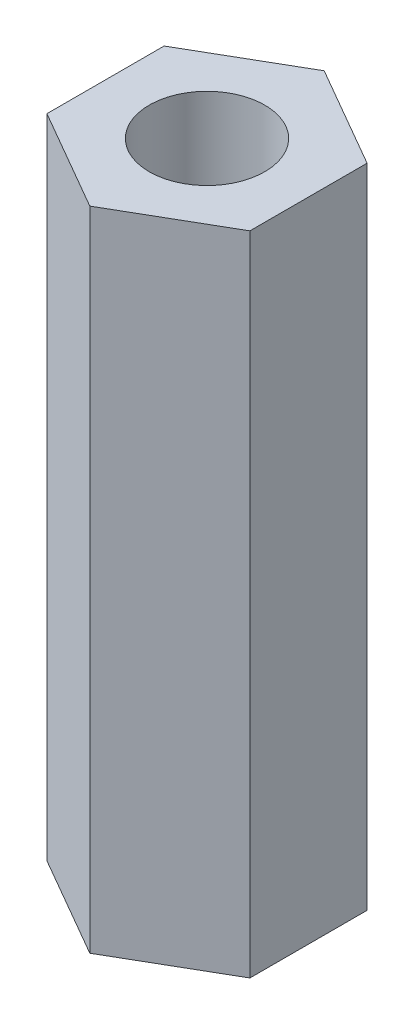
ISO-10303-21;
HEADER;
FILE_DESCRIPTION(('STEP AP214'),'2;1');
FILE_NAME('part.step','',(''),(''),'','','');
FILE_SCHEMA(('AUTOMOTIVE_DESIGN { 1 0 10303 214 1 1 1 1 }'));
ENDSEC;
DATA;
#1=APPLICATION_CONTEXT('core data for automotive mechanical design processes');
#2=APPLICATION_PROTOCOL_DEFINITION('international standard','automotive_design',2000,#1);
#3=PRODUCT_CONTEXT('',#1,'mechanical');
#4=PRODUCT('Part','Part','',(#3));
#5=PRODUCT_RELATED_PRODUCT_CATEGORY('part','',(#4));
#6=PRODUCT_DEFINITION_FORMATION('','',#4);
#7=PRODUCT_DEFINITION_CONTEXT('part definition',#1,'design');
#8=PRODUCT_DEFINITION('design','',#6,#7);
#9=PRODUCT_DEFINITION_SHAPE('','',#8);
#10=(LENGTH_UNIT() NAMED_UNIT(*) SI_UNIT(.MILLI.,.METRE.));
#11=(NAMED_UNIT(*) PLANE_ANGLE_UNIT() SI_UNIT($,.RADIAN.));
#12=(NAMED_UNIT(*) SI_UNIT($,.STERADIAN.) SOLID_ANGLE_UNIT());
#13=UNCERTAINTY_MEASURE_WITH_UNIT(LENGTH_MEASURE(1.E-05),#10,'distance_accuracy_value','');
#14=(GEOMETRIC_REPRESENTATION_CONTEXT(3) GLOBAL_UNCERTAINTY_ASSIGNED_CONTEXT((#13)) GLOBAL_UNIT_ASSIGNED_CONTEXT((#10,
#11,#12)) REPRESENTATION_CONTEXT('',''));
#15=CARTESIAN_POINT('',(0.,0.,0.));
#16=DIRECTION('',(0.,0.,1.));
#17=DIRECTION('',(1.,0.,0.));
#18=AXIS2_PLACEMENT_3D('',#15,#16,#17);
#19=CARTESIAN_POINT('',(0.,16.8,0.));
#20=DIRECTION('',(0.,1.,0.));
#21=DIRECTION('',(0.,0.,1.));
#22=AXIS2_PLACEMENT_3D('',#19,#20,#21);
#23=PLANE('',#22);
#24=DIRECTION('',(-0.866025403784439,0.,-0.5));
#25=VECTOR('',#24,1.);
#26=CARTESIAN_POINT('',(2.635,16.8,-1.52131795931467));
#27=LINE('',#26,#25);
#28=CARTESIAN_POINT('',(2.635,16.8,-1.52131795931467));
#29=VERTEX_POINT('',#28);
#30=CARTESIAN_POINT('',(0.,16.8,-3.04263591862933));
#31=VERTEX_POINT('',#30);
#32=EDGE_CURVE('E131',#29,#31,#27,.T.);
#33=ORIENTED_EDGE('',*,*,#32,.T.);
#34=DIRECTION('',(-0.866025403784439,0.,0.5));
#35=VECTOR('',#34,1.);
#36=CARTESIAN_POINT('',(0.,16.8,-3.04263591862933));
#37=LINE('',#36,#35);
#38=CARTESIAN_POINT('',(-2.635,16.8,-1.52131795931466));
#39=VERTEX_POINT('',#38);
#40=EDGE_CURVE('E89',#31,#39,#37,.T.);
#41=ORIENTED_EDGE('',*,*,#40,.T.);
#42=DIRECTION('',(0.,0.,1.));
#43=VECTOR('',#42,1.);
#44=CARTESIAN_POINT('',(-2.635,16.8,-1.52131795931466));
#45=LINE('',#44,#43);
#46=CARTESIAN_POINT('',(-2.635,16.8,1.52131795931466));
#47=VERTEX_POINT('',#46);
#48=EDGE_CURVE('E102',#39,#47,#45,.T.);
#49=ORIENTED_EDGE('',*,*,#48,.T.);
#50=DIRECTION('',(0.866025403784439,0.,0.5));
#51=VECTOR('',#50,1.);
#52=CARTESIAN_POINT('',(-2.635,16.8,1.52131795931466));
#53=LINE('',#52,#51);
#54=CARTESIAN_POINT('',(0.,16.8,3.04263591862933));
#55=VERTEX_POINT('',#54);
#56=EDGE_CURVE('E96',#47,#55,#53,.T.);
#57=ORIENTED_EDGE('',*,*,#56,.T.);
#58=DIRECTION('',(0.866025403784439,0.,-0.5));
#59=VECTOR('',#58,1.);
#60=CARTESIAN_POINT('',(0.,16.8,3.04263591862933));
#61=LINE('',#60,#59);
#62=CARTESIAN_POINT('',(2.635,16.8,1.52131795931466));
#63=VERTEX_POINT('',#62);
#64=EDGE_CURVE('E100',#55,#63,#61,.T.);
#65=ORIENTED_EDGE('',*,*,#64,.T.);
#66=DIRECTION('',(0.,0.,-1.));
#67=VECTOR('',#66,1.);
#68=CARTESIAN_POINT('',(2.635,16.8,1.52131795931466));
#69=LINE('',#68,#67);
#70=EDGE_CURVE('E52',#63,#29,#69,.T.);
#71=ORIENTED_EDGE('',*,*,#70,.T.);
#72=EDGE_LOOP('',(#33,#41,#49,#57,#65,#71));
#73=FACE_BOUND('',#72,.T.);
#74=CARTESIAN_POINT('',(0.,16.8,0.));
#75=DIRECTION('',(0.,1.,0.));
#76=DIRECTION('',(0.,0.,1.));
#77=AXIS2_PLACEMENT_3D('',#74,#75,#76);
#78=CIRCLE('',#77,1.5);
#79=CARTESIAN_POINT('',(0.,16.8,1.5));
#80=VERTEX_POINT('',#79);
#81=EDGE_CURVE('E124',#80,#80,#78,.T.);
#82=ORIENTED_EDGE('',*,*,#81,.F.);
#83=EDGE_LOOP('',(#82));
#84=FACE_BOUND('',#83,.T.);
#85=ADVANCED_FACE('F35',(#73,#84),#23,.T.);
#86=CARTESIAN_POINT('',(0.,0.,0.));
#87=DIRECTION('',(0.,1.,0.));
#88=DIRECTION('',(0.,0.,1.));
#89=AXIS2_PLACEMENT_3D('',#86,#87,#88);
#90=PLANE('',#89);
#91=DIRECTION('',(-0.866025403784439,0.,-0.5));
#92=VECTOR('',#91,1.);
#93=CARTESIAN_POINT('',(2.635,0.,-1.52131795931467));
#94=LINE('',#93,#92);
#95=CARTESIAN_POINT('',(2.635,0.,-1.52131795931467));
#96=VERTEX_POINT('',#95);
#97=CARTESIAN_POINT('',(0.,0.,-3.04263591862933));
#98=VERTEX_POINT('',#97);
#99=EDGE_CURVE('E120',#96,#98,#94,.T.);
#100=ORIENTED_EDGE('',*,*,#99,.F.);
#101=DIRECTION('',(0.,0.,-1.));
#102=VECTOR('',#101,1.);
#103=CARTESIAN_POINT('',(2.635,0.,1.52131795931466));
#104=LINE('',#103,#102);
#105=CARTESIAN_POINT('',(2.635,0.,1.52131795931466));
#106=VERTEX_POINT('',#105);
#107=EDGE_CURVE('E81',#106,#96,#104,.T.);
#108=ORIENTED_EDGE('',*,*,#107,.F.);
#109=DIRECTION('',(0.866025403784439,0.,-0.5));
#110=VECTOR('',#109,1.);
#111=CARTESIAN_POINT('',(0.,0.,3.04263591862933));
#112=LINE('',#111,#110);
#113=CARTESIAN_POINT('',(0.,0.,3.04263591862933));
#114=VERTEX_POINT('',#113);
#115=EDGE_CURVE('E75',#114,#106,#112,.T.);
#116=ORIENTED_EDGE('',*,*,#115,.F.);
#117=DIRECTION('',(0.866025403784439,0.,0.5));
#118=VECTOR('',#117,1.);
#119=CARTESIAN_POINT('',(-2.635,0.,1.52131795931466));
#120=LINE('',#119,#118);
#121=CARTESIAN_POINT('',(-2.635,0.,1.52131795931466));
#122=VERTEX_POINT('',#121);
#123=EDGE_CURVE('E110',#122,#114,#120,.T.);
#124=ORIENTED_EDGE('',*,*,#123,.F.);
#125=DIRECTION('',(0.,0.,1.));
#126=VECTOR('',#125,1.);
#127=CARTESIAN_POINT('',(-2.635,0.,-1.52131795931466));
#128=LINE('',#127,#126);
#129=CARTESIAN_POINT('',(-2.635,0.,-1.52131795931466));
#130=VERTEX_POINT('',#129);
#131=EDGE_CURVE('E126',#130,#122,#128,.T.);
#132=ORIENTED_EDGE('',*,*,#131,.F.);
#133=DIRECTION('',(-0.866025403784439,0.,0.5));
#134=VECTOR('',#133,1.);
#135=CARTESIAN_POINT('',(0.,0.,-3.04263591862933));
#136=LINE('',#135,#134);
#137=EDGE_CURVE('E123',#98,#130,#136,.T.);
#138=ORIENTED_EDGE('',*,*,#137,.F.);
#139=EDGE_LOOP('',(#100,#108,#116,#124,#132,#138));
#140=FACE_BOUND('',#139,.T.);
#141=CARTESIAN_POINT('',(0.,0.,0.));
#142=DIRECTION('',(0.,1.,0.));
#143=DIRECTION('',(0.,0.,1.));
#144=AXIS2_PLACEMENT_3D('',#141,#142,#143);
#145=CIRCLE('',#144,1.5);
#146=CARTESIAN_POINT('',(0.,0.,1.5));
#147=VERTEX_POINT('',#146);
#148=EDGE_CURVE('E224',#147,#147,#145,.T.);
#149=ORIENTED_EDGE('',*,*,#148,.T.);
#150=EDGE_LOOP('',(#149));
#151=FACE_BOUND('',#150,.T.);
#152=ADVANCED_FACE('F140',(#140,#151),#90,.F.);
#153=CARTESIAN_POINT('',(2.635,16.8,-1.52131795931467));
#154=DIRECTION('',(-0.5,0.,0.866025403784439));
#155=DIRECTION('',(0.866025403784439,0.,0.5));
#156=AXIS2_PLACEMENT_3D('',#153,#154,#155);
#157=PLANE('',#156);
#158=ORIENTED_EDGE('',*,*,#99,.T.);
#159=DIRECTION('',(0.,-1.,0.));
#160=VECTOR('',#159,1.);
#161=CARTESIAN_POINT('',(0.,16.8,-3.04263591862933));
#162=LINE('',#161,#160);
#163=EDGE_CURVE('E11',#31,#98,#162,.T.);
#164=ORIENTED_EDGE('',*,*,#163,.F.);
#165=ORIENTED_EDGE('',*,*,#32,.F.);
#166=DIRECTION('',(0.,-1.,0.));
#167=VECTOR('',#166,1.);
#168=CARTESIAN_POINT('',(2.635,16.8,-1.52131795931467));
#169=LINE('',#168,#167);
#170=EDGE_CURVE('E116',#29,#96,#169,.T.);
#171=ORIENTED_EDGE('',*,*,#170,.T.);
#172=EDGE_LOOP('',(#158,#164,#165,#171));
#173=FACE_BOUND('',#172,.T.);
#174=ADVANCED_FACE('F37',(#173),#157,.F.);
#175=CARTESIAN_POINT('',(0.,16.8,-3.04263591862933));
#176=DIRECTION('',(0.5,0.,0.866025403784439));
#177=DIRECTION('',(0.866025403784439,0.,-0.5));
#178=AXIS2_PLACEMENT_3D('',#175,#176,#177);
#179=PLANE('',#178);
#180=ORIENTED_EDGE('',*,*,#137,.T.);
#181=DIRECTION('',(0.,-1.,0.));
#182=VECTOR('',#181,1.);
#183=CARTESIAN_POINT('',(-2.635,16.8,-1.52131795931466));
#184=LINE('',#183,#182);
#185=EDGE_CURVE('E44',#39,#130,#184,.T.);
#186=ORIENTED_EDGE('',*,*,#185,.F.);
#187=ORIENTED_EDGE('',*,*,#40,.F.);
#188=ORIENTED_EDGE('',*,*,#163,.T.);
#189=EDGE_LOOP('',(#180,#186,#187,#188));
#190=FACE_BOUND('',#189,.T.);
#191=ADVANCED_FACE('F165',(#190),#179,.F.);
#192=CARTESIAN_POINT('',(-2.635,16.8,-1.52131795931466));
#193=DIRECTION('',(1.,0.,0.));
#194=DIRECTION('',(0.,0.,-1.));
#195=AXIS2_PLACEMENT_3D('',#192,#193,#194);
#196=PLANE('',#195);
#197=ORIENTED_EDGE('',*,*,#131,.T.);
#198=DIRECTION('',(0.,-1.,0.));
#199=VECTOR('',#198,1.);
#200=CARTESIAN_POINT('',(-2.635,16.8,1.52131795931466));
#201=LINE('',#200,#199);
#202=EDGE_CURVE('E111',#47,#122,#201,.T.);
#203=ORIENTED_EDGE('',*,*,#202,.F.);
#204=ORIENTED_EDGE('',*,*,#48,.F.);
#205=ORIENTED_EDGE('',*,*,#185,.T.);
#206=EDGE_LOOP('',(#197,#203,#204,#205));
#207=FACE_BOUND('',#206,.T.);
#208=ADVANCED_FACE('F137',(#207),#196,.F.);
#209=CARTESIAN_POINT('',(-2.635,16.8,1.52131795931466));
#210=DIRECTION('',(0.5,0.,-0.866025403784439));
#211=DIRECTION('',(-0.866025403784439,0.,-0.5));
#212=AXIS2_PLACEMENT_3D('',#209,#210,#211);
#213=PLANE('',#212);
#214=ORIENTED_EDGE('',*,*,#123,.T.);
#215=DIRECTION('',(0.,-1.,0.));
#216=VECTOR('',#215,1.);
#217=CARTESIAN_POINT('',(0.,16.8,3.04263591862933));
#218=LINE('',#217,#216);
#219=EDGE_CURVE('E107',#55,#114,#218,.T.);
#220=ORIENTED_EDGE('',*,*,#219,.F.);
#221=ORIENTED_EDGE('',*,*,#56,.F.);
#222=ORIENTED_EDGE('',*,*,#202,.T.);
#223=EDGE_LOOP('',(#214,#220,#221,#222));
#224=FACE_BOUND('',#223,.T.);
#225=ADVANCED_FACE('F108',(#224),#213,.F.);
#226=CARTESIAN_POINT('',(0.,16.8,3.04263591862933));
#227=DIRECTION('',(-0.5,0.,-0.866025403784439));
#228=DIRECTION('',(-0.866025403784439,0.,0.5));
#229=AXIS2_PLACEMENT_3D('',#226,#227,#228);
#230=PLANE('',#229);
#231=ORIENTED_EDGE('',*,*,#115,.T.);
#232=DIRECTION('',(0.,-1.,0.));
#233=VECTOR('',#232,1.);
#234=CARTESIAN_POINT('',(2.635,16.8,1.52131795931466));
#235=LINE('',#234,#233);
#236=EDGE_CURVE('E112',#63,#106,#235,.T.);
#237=ORIENTED_EDGE('',*,*,#236,.F.);
#238=ORIENTED_EDGE('',*,*,#64,.F.);
#239=ORIENTED_EDGE('',*,*,#219,.T.);
#240=EDGE_LOOP('',(#231,#237,#238,#239));
#241=FACE_BOUND('',#240,.T.);
#242=ADVANCED_FACE('F114',(#241),#230,.F.);
#243=CARTESIAN_POINT('',(2.635,16.8,1.52131795931466));
#244=DIRECTION('',(-1.,0.,0.));
#245=DIRECTION('',(0.,0.,1.));
#246=AXIS2_PLACEMENT_3D('',#243,#244,#245);
#247=PLANE('',#246);
#248=ORIENTED_EDGE('',*,*,#107,.T.);
#249=ORIENTED_EDGE('',*,*,#170,.F.);
#250=ORIENTED_EDGE('',*,*,#70,.F.);
#251=ORIENTED_EDGE('',*,*,#236,.T.);
#252=EDGE_LOOP('',(#248,#249,#250,#251));
#253=FACE_BOUND('',#252,.T.);
#254=ADVANCED_FACE('F145',(#253),#247,.F.);
#255=CARTESIAN_POINT('',(0.,16.8,0.));
#256=DIRECTION('',(0.,-1.,0.));
#257=DIRECTION('',(0.,0.,-1.));
#258=AXIS2_PLACEMENT_3D('',#255,#256,#257);
#259=CYLINDRICAL_SURFACE('',#258,1.5);
#260=ORIENTED_EDGE('',*,*,#81,.T.);
#261=EDGE_LOOP('',(#260));
#262=FACE_BOUND('',#261,.T.);
#263=ORIENTED_EDGE('',*,*,#148,.F.);
#264=EDGE_LOOP('',(#263));
#265=FACE_BOUND('',#264,.T.);
#266=ADVANCED_FACE('F147',(#262,#265),#259,.F.);
#267=CLOSED_SHELL('',(#85,#152,#174,#191,#208,#225,#242,#254,#266));
#268=MANIFOLD_SOLID_BREP('B2',#267);
#269=ADVANCED_BREP_SHAPE_REPRESENTATION('',(#18,#268),#14);
#270=SHAPE_DEFINITION_REPRESENTATION(#9,#269);
ENDSEC;
END-ISO-10303-21;
